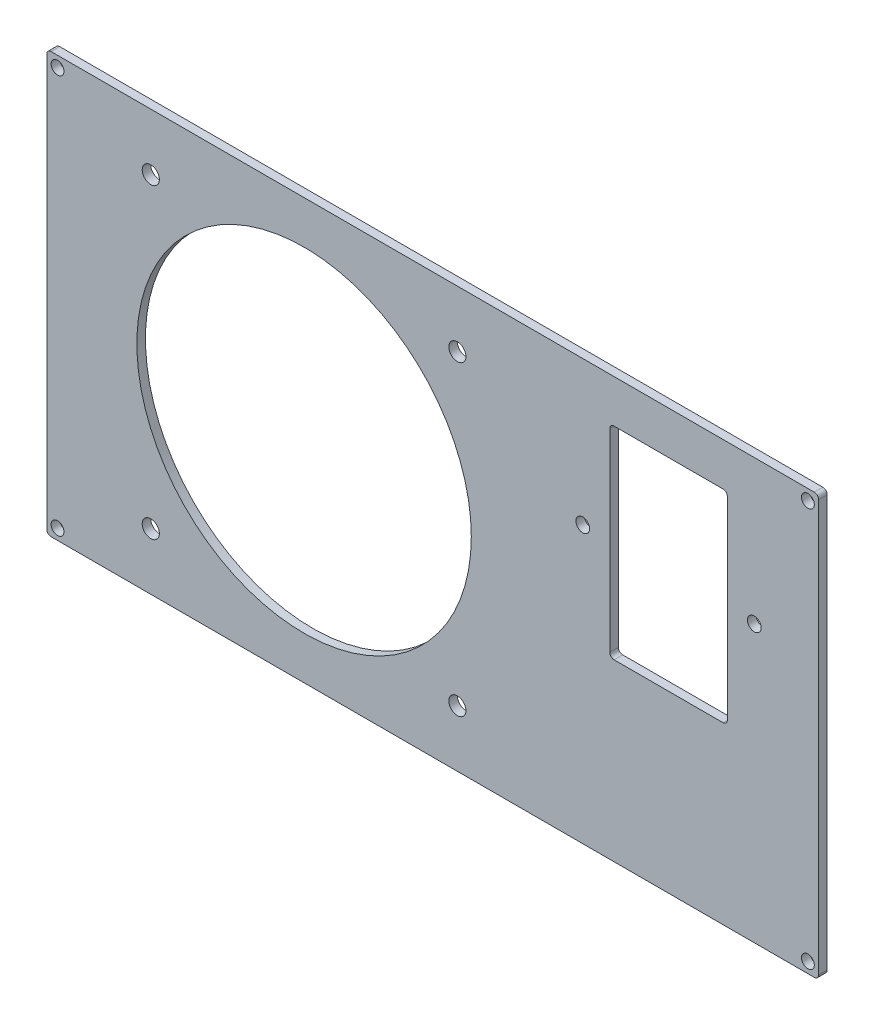
ISO-10303-21;
HEADER;
FILE_DESCRIPTION(('STEP AP214'),'2;1');
FILE_NAME('part.step','',(''),(''),'','','');
FILE_SCHEMA(('AUTOMOTIVE_DESIGN { 1 0 10303 214 1 1 1 1 }'));
ENDSEC;
DATA;
#1=APPLICATION_CONTEXT('core data for automotive mechanical design processes');
#2=APPLICATION_PROTOCOL_DEFINITION('international standard','automotive_design',2000,#1);
#3=PRODUCT_CONTEXT('',#1,'mechanical');
#4=PRODUCT('Part','Part','',(#3));
#5=PRODUCT_RELATED_PRODUCT_CATEGORY('part','',(#4));
#6=PRODUCT_DEFINITION_FORMATION('','',#4);
#7=PRODUCT_DEFINITION_CONTEXT('part definition',#1,'design');
#8=PRODUCT_DEFINITION('design','',#6,#7);
#9=PRODUCT_DEFINITION_SHAPE('','',#8);
#10=(LENGTH_UNIT() NAMED_UNIT(*) SI_UNIT(.MILLI.,.METRE.));
#11=(NAMED_UNIT(*) PLANE_ANGLE_UNIT() SI_UNIT($,.RADIAN.));
#12=(NAMED_UNIT(*) SI_UNIT($,.STERADIAN.) SOLID_ANGLE_UNIT());
#13=UNCERTAINTY_MEASURE_WITH_UNIT(LENGTH_MEASURE(1.E-05),#10,'distance_accuracy_value','');
#14=(GEOMETRIC_REPRESENTATION_CONTEXT(3) GLOBAL_UNCERTAINTY_ASSIGNED_CONTEXT((#13)) GLOBAL_UNIT_ASSIGNED_CONTEXT((#10,
#11,#12)) REPRESENTATION_CONTEXT('',''));
#15=CARTESIAN_POINT('',(0.,0.,0.));
#16=DIRECTION('',(0.,0.,1.));
#17=DIRECTION('',(1.,0.,0.));
#18=AXIS2_PLACEMENT_3D('',#15,#16,#17);
#19=CARTESIAN_POINT('',(0.,0.,2.));
#20=DIRECTION('',(0.,0.,-1.));
#21=DIRECTION('',(-1.,0.,0.));
#22=AXIS2_PLACEMENT_3D('',#19,#20,#21);
#23=PLANE('',#22);
#24=CARTESIAN_POINT('',(24.25,13.25,2.));
#25=DIRECTION('',(0.,0.,1.));
#26=DIRECTION('',(1.,0.,0.));
#27=AXIS2_PLACEMENT_3D('',#24,#25,#26);
#28=CIRCLE('',#27,2.);
#29=CARTESIAN_POINT('',(26.25,13.25,2.));
#30=VERTEX_POINT('',#29);
#31=EDGE_CURVE('E273',#30,#30,#28,.T.);
#32=ORIENTED_EDGE('',*,*,#31,.F.);
#33=EDGE_LOOP('',(#32));
#34=FACE_BOUND('',#33,.T.);
#35=CARTESIAN_POINT('',(95.75,13.25,2.));
#36=DIRECTION('',(0.,0.,1.));
#37=DIRECTION('',(1.,0.,0.));
#38=AXIS2_PLACEMENT_3D('',#35,#36,#37);
#39=CIRCLE('',#38,2.);
#40=CARTESIAN_POINT('',(97.75,13.25,2.));
#41=VERTEX_POINT('',#40);
#42=EDGE_CURVE('E289',#41,#41,#39,.T.);
#43=ORIENTED_EDGE('',*,*,#42,.F.);
#44=EDGE_LOOP('',(#43));
#45=FACE_BOUND('',#44,.T.);
#46=CARTESIAN_POINT('',(95.75,84.75,2.));
#47=DIRECTION('',(0.,0.,1.));
#48=DIRECTION('',(1.,0.,0.));
#49=AXIS2_PLACEMENT_3D('',#46,#47,#48);
#50=CIRCLE('',#49,2.);
#51=CARTESIAN_POINT('',(97.75,84.75,2.));
#52=VERTEX_POINT('',#51);
#53=EDGE_CURVE('E295',#52,#52,#50,.T.);
#54=ORIENTED_EDGE('',*,*,#53,.F.);
#55=EDGE_LOOP('',(#54));
#56=FACE_BOUND('',#55,.T.);
#57=CARTESIAN_POINT('',(24.25,84.75,2.));
#58=DIRECTION('',(0.,0.,1.));
#59=DIRECTION('',(1.,0.,0.));
#60=AXIS2_PLACEMENT_3D('',#57,#58,#59);
#61=CIRCLE('',#60,2.);
#62=CARTESIAN_POINT('',(26.25,84.75,2.));
#63=VERTEX_POINT('',#62);
#64=EDGE_CURVE('E301',#63,#63,#61,.T.);
#65=ORIENTED_EDGE('',*,*,#64,.F.);
#66=EDGE_LOOP('',(#65));
#67=FACE_BOUND('',#66,.T.);
#68=CARTESIAN_POINT('',(60.,49.,2.));
#69=DIRECTION('',(0.,0.,1.));
#70=DIRECTION('',(1.,0.,0.));
#71=AXIS2_PLACEMENT_3D('',#68,#69,#70);
#72=CIRCLE('',#71,39.);
#73=CARTESIAN_POINT('',(99.,49.,2.));
#74=VERTEX_POINT('',#73);
#75=EDGE_CURVE('E307',#74,#74,#72,.T.);
#76=ORIENTED_EDGE('',*,*,#75,.F.);
#77=EDGE_LOOP('',(#76));
#78=FACE_BOUND('',#77,.T.);
#79=CARTESIAN_POINT('',(2.50000000000001,2.49999999999999,2.));
#80=DIRECTION('',(0.,0.,1.));
#81=DIRECTION('',(1.,0.,0.));
#82=AXIS2_PLACEMENT_3D('',#79,#80,#81);
#83=CIRCLE('',#82,1.5);
#84=CARTESIAN_POINT('',(4.00000000000001,2.49999999999999,2.));
#85=VERTEX_POINT('',#84);
#86=EDGE_CURVE('E313',#85,#85,#83,.T.);
#87=ORIENTED_EDGE('',*,*,#86,.F.);
#88=EDGE_LOOP('',(#87));
#89=FACE_BOUND('',#88,.T.);
#90=CARTESIAN_POINT('',(177.5,2.49999999999999,2.));
#91=DIRECTION('',(0.,0.,1.));
#92=DIRECTION('',(1.,0.,0.));
#93=AXIS2_PLACEMENT_3D('',#90,#91,#92);
#94=CIRCLE('',#93,1.5);
#95=CARTESIAN_POINT('',(179.,2.49999999999999,2.));
#96=VERTEX_POINT('',#95);
#97=EDGE_CURVE('E319',#96,#96,#94,.T.);
#98=ORIENTED_EDGE('',*,*,#97,.F.);
#99=EDGE_LOOP('',(#98));
#100=FACE_BOUND('',#99,.T.);
#101=CARTESIAN_POINT('',(177.5,95.5,2.));
#102=DIRECTION('',(0.,0.,1.));
#103=DIRECTION('',(1.,0.,0.));
#104=AXIS2_PLACEMENT_3D('',#101,#102,#103);
#105=CIRCLE('',#104,1.5);
#106=CARTESIAN_POINT('',(179.,95.5,2.));
#107=VERTEX_POINT('',#106);
#108=EDGE_CURVE('E325',#107,#107,#105,.T.);
#109=ORIENTED_EDGE('',*,*,#108,.F.);
#110=EDGE_LOOP('',(#109));
#111=FACE_BOUND('',#110,.T.);
#112=CARTESIAN_POINT('',(2.50000000000001,95.5,2.));
#113=DIRECTION('',(0.,0.,1.));
#114=DIRECTION('',(1.,0.,0.));
#115=AXIS2_PLACEMENT_3D('',#112,#113,#114);
#116=CIRCLE('',#115,1.5);
#117=CARTESIAN_POINT('',(4.00000000000001,95.5,2.));
#118=VERTEX_POINT('',#117);
#119=EDGE_CURVE('E176',#118,#118,#116,.T.);
#120=ORIENTED_EDGE('',*,*,#119,.F.);
#121=EDGE_LOOP('',(#120));
#122=FACE_BOUND('',#121,.T.);
#123=DIRECTION('',(-1.,0.,0.));
#124=VECTOR('',#123,1.);
#125=CARTESIAN_POINT('',(0.,98.,2.));
#126=LINE('',#125,#124);
#127=CARTESIAN_POINT('',(179.,98.,2.));
#128=VERTEX_POINT('',#127);
#129=CARTESIAN_POINT('',(1.,98.,2.));
#130=VERTEX_POINT('',#129);
#131=EDGE_CURVE('E185',#128,#130,#126,.T.);
#132=ORIENTED_EDGE('',*,*,#131,.T.);
#133=CARTESIAN_POINT('',(1.,97.,2.));
#134=DIRECTION('',(0.,0.,-1.));
#135=DIRECTION('',(-1.,0.,0.));
#136=AXIS2_PLACEMENT_3D('',#133,#134,#135);
#137=CIRCLE('',#136,1.);
#138=CARTESIAN_POINT('',(0.,97.,2.));
#139=VERTEX_POINT('',#138);
#140=EDGE_CURVE('E206',#130,#139,#137,.F.);
#141=ORIENTED_EDGE('',*,*,#140,.T.);
#142=DIRECTION('',(0.,-1.,0.));
#143=VECTOR('',#142,1.);
#144=CARTESIAN_POINT('',(0.,0.,2.));
#145=LINE('',#144,#143);
#146=CARTESIAN_POINT('',(0.,1.,2.));
#147=VERTEX_POINT('',#146);
#148=EDGE_CURVE('E168',#139,#147,#145,.T.);
#149=ORIENTED_EDGE('',*,*,#148,.T.);
#150=CARTESIAN_POINT('',(1.,1.,2.));
#151=DIRECTION('',(0.,0.,-1.));
#152=DIRECTION('',(-1.,0.,0.));
#153=AXIS2_PLACEMENT_3D('',#150,#151,#152);
#154=CIRCLE('',#153,1.);
#155=CARTESIAN_POINT('',(1.,0.,2.));
#156=VERTEX_POINT('',#155);
#157=EDGE_CURVE('E204',#147,#156,#154,.F.);
#158=ORIENTED_EDGE('',*,*,#157,.T.);
#159=DIRECTION('',(1.,0.,0.));
#160=VECTOR('',#159,1.);
#161=CARTESIAN_POINT('',(0.,0.,2.));
#162=LINE('',#161,#160);
#163=CARTESIAN_POINT('',(179.,0.,2.));
#164=VERTEX_POINT('',#163);
#165=EDGE_CURVE('E333',#156,#164,#162,.T.);
#166=ORIENTED_EDGE('',*,*,#165,.T.);
#167=CARTESIAN_POINT('',(179.,1.,2.));
#168=DIRECTION('',(0.,0.,-1.));
#169=DIRECTION('',(-1.,0.,0.));
#170=AXIS2_PLACEMENT_3D('',#167,#168,#169);
#171=CIRCLE('',#170,1.);
#172=CARTESIAN_POINT('',(180.,1.,2.));
#173=VERTEX_POINT('',#172);
#174=EDGE_CURVE('E202',#164,#173,#171,.F.);
#175=ORIENTED_EDGE('',*,*,#174,.T.);
#176=DIRECTION('',(0.,1.,0.));
#177=VECTOR('',#176,1.);
#178=CARTESIAN_POINT('',(180.,0.,2.));
#179=LINE('',#178,#177);
#180=CARTESIAN_POINT('',(180.,97.,2.));
#181=VERTEX_POINT('',#180);
#182=EDGE_CURVE('E335',#173,#181,#179,.T.);
#183=ORIENTED_EDGE('',*,*,#182,.T.);
#184=CARTESIAN_POINT('',(179.,97.,2.));
#185=DIRECTION('',(0.,0.,-1.));
#186=DIRECTION('',(-1.,0.,0.));
#187=AXIS2_PLACEMENT_3D('',#184,#185,#186);
#188=CIRCLE('',#187,1.);
#189=EDGE_CURVE('E200',#181,#128,#188,.F.);
#190=ORIENTED_EDGE('',*,*,#189,.T.);
#191=EDGE_LOOP('',(#132,#141,#149,#158,#166,#175,#183,#190));
#192=FACE_BOUND('',#191,.T.);
#193=DIRECTION('',(0.,1.,0.));
#194=VECTOR('',#193,1.);
#195=CARTESIAN_POINT('',(158.7,88.,2.));
#196=LINE('',#195,#194);
#197=CARTESIAN_POINT('',(158.7,41.8,2.));
#198=VERTEX_POINT('',#197);
#199=CARTESIAN_POINT('',(158.7,87.,2.));
#200=VERTEX_POINT('',#199);
#201=EDGE_CURVE('E285',#198,#200,#196,.T.);
#202=ORIENTED_EDGE('',*,*,#201,.F.);
#203=CARTESIAN_POINT('',(157.7,41.8,2.));
#204=DIRECTION('',(0.,0.,-1.));
#205=DIRECTION('',(-1.,0.,0.));
#206=AXIS2_PLACEMENT_3D('',#203,#204,#205);
#207=CIRCLE('',#206,1.);
#208=CARTESIAN_POINT('',(157.7,40.8,2.));
#209=VERTEX_POINT('',#208);
#210=EDGE_CURVE('E11',#198,#209,#207,.T.);
#211=ORIENTED_EDGE('',*,*,#210,.T.);
#212=DIRECTION('',(1.,0.,0.));
#213=VECTOR('',#212,1.);
#214=CARTESIAN_POINT('',(131.3,40.8,2.));
#215=LINE('',#214,#213);
#216=CARTESIAN_POINT('',(132.3,40.8,2.));
#217=VERTEX_POINT('',#216);
#218=EDGE_CURVE('E267',#217,#209,#215,.T.);
#219=ORIENTED_EDGE('',*,*,#218,.F.);
#220=CARTESIAN_POINT('',(132.3,41.8,2.));
#221=DIRECTION('',(0.,0.,-1.));
#222=DIRECTION('',(-1.,0.,0.));
#223=AXIS2_PLACEMENT_3D('',#220,#221,#222);
#224=CIRCLE('',#223,1.);
#225=CARTESIAN_POINT('',(131.3,41.8,2.));
#226=VERTEX_POINT('',#225);
#227=EDGE_CURVE('E247',#217,#226,#224,.T.);
#228=ORIENTED_EDGE('',*,*,#227,.T.);
#229=DIRECTION('',(0.,-1.,0.));
#230=VECTOR('',#229,1.);
#231=CARTESIAN_POINT('',(131.3,88.,2.));
#232=LINE('',#231,#230);
#233=CARTESIAN_POINT('',(131.3,87.,2.));
#234=VERTEX_POINT('',#233);
#235=EDGE_CURVE('E270',#234,#226,#232,.T.);
#236=ORIENTED_EDGE('',*,*,#235,.F.);
#237=CARTESIAN_POINT('',(132.3,87.,2.));
#238=DIRECTION('',(0.,0.,-1.));
#239=DIRECTION('',(-1.,0.,0.));
#240=AXIS2_PLACEMENT_3D('',#237,#238,#239);
#241=CIRCLE('',#240,1.);
#242=CARTESIAN_POINT('',(132.3,88.,2.));
#243=VERTEX_POINT('',#242);
#244=EDGE_CURVE('E243',#234,#243,#241,.T.);
#245=ORIENTED_EDGE('',*,*,#244,.T.);
#246=DIRECTION('',(-1.,0.,0.));
#247=VECTOR('',#246,1.);
#248=CARTESIAN_POINT('',(131.3,88.,2.));
#249=LINE('',#248,#247);
#250=CARTESIAN_POINT('',(157.7,88.,2.));
#251=VERTEX_POINT('',#250);
#252=EDGE_CURVE('E276',#251,#243,#249,.T.);
#253=ORIENTED_EDGE('',*,*,#252,.F.);
#254=CARTESIAN_POINT('',(157.7,87.,2.));
#255=DIRECTION('',(0.,0.,-1.));
#256=DIRECTION('',(-1.,0.,0.));
#257=AXIS2_PLACEMENT_3D('',#254,#255,#256);
#258=CIRCLE('',#257,1.);
#259=EDGE_CURVE('E239',#251,#200,#258,.T.);
#260=ORIENTED_EDGE('',*,*,#259,.T.);
#261=EDGE_LOOP('',(#202,#211,#219,#228,#236,#245,#253,#260));
#262=FACE_BOUND('',#261,.T.);
#263=CARTESIAN_POINT('',(125.,64.4,2.));
#264=DIRECTION('',(0.,0.,1.));
#265=DIRECTION('',(1.,0.,0.));
#266=AXIS2_PLACEMENT_3D('',#263,#264,#265);
#267=CIRCLE('',#266,1.60000000000001);
#268=CARTESIAN_POINT('',(126.6,64.4,2.));
#269=VERTEX_POINT('',#268);
#270=EDGE_CURVE('E264',#269,#269,#267,.T.);
#271=ORIENTED_EDGE('',*,*,#270,.F.);
#272=EDGE_LOOP('',(#271));
#273=FACE_BOUND('',#272,.T.);
#274=CARTESIAN_POINT('',(165.,64.4,2.));
#275=DIRECTION('',(0.,0.,1.));
#276=DIRECTION('',(1.,0.,0.));
#277=AXIS2_PLACEMENT_3D('',#274,#275,#276);
#278=CIRCLE('',#277,1.59999999999999);
#279=CARTESIAN_POINT('',(166.6,64.4,2.));
#280=VERTEX_POINT('',#279);
#281=EDGE_CURVE('E646',#280,#280,#278,.T.);
#282=ORIENTED_EDGE('',*,*,#281,.F.);
#283=EDGE_LOOP('',(#282));
#284=FACE_BOUND('',#283,.T.);
#285=ADVANCED_FACE('F35',(#34,#45,#56,#67,#78,#89,#100,#111,#122,#192,#262,#273,#284),#23,.F.);
#286=CARTESIAN_POINT('',(0.,0.,0.));
#287=DIRECTION('',(0.,0.,-1.));
#288=DIRECTION('',(-1.,0.,0.));
#289=AXIS2_PLACEMENT_3D('',#286,#287,#288);
#290=PLANE('',#289);
#291=CARTESIAN_POINT('',(125.,64.4,0.));
#292=DIRECTION('',(0.,0.,1.));
#293=DIRECTION('',(1.,0.,0.));
#294=AXIS2_PLACEMENT_3D('',#291,#292,#293);
#295=CIRCLE('',#294,1.60000000000001);
#296=CARTESIAN_POINT('',(126.6,64.4,0.));
#297=VERTEX_POINT('',#296);
#298=EDGE_CURVE('E643',#297,#297,#295,.T.);
#299=ORIENTED_EDGE('',*,*,#298,.T.);
#300=EDGE_LOOP('',(#299));
#301=FACE_BOUND('',#300,.T.);
#302=CARTESIAN_POINT('',(95.75,13.25,0.));
#303=DIRECTION('',(0.,0.,1.));
#304=DIRECTION('',(1.,0.,0.));
#305=AXIS2_PLACEMENT_3D('',#302,#303,#304);
#306=CIRCLE('',#305,2.);
#307=CARTESIAN_POINT('',(97.75,13.25,0.));
#308=VERTEX_POINT('',#307);
#309=EDGE_CURVE('E287',#308,#308,#306,.T.);
#310=ORIENTED_EDGE('',*,*,#309,.T.);
#311=EDGE_LOOP('',(#310));
#312=FACE_BOUND('',#311,.T.);
#313=CARTESIAN_POINT('',(24.25,84.75,0.));
#314=DIRECTION('',(0.,0.,1.));
#315=DIRECTION('',(1.,0.,0.));
#316=AXIS2_PLACEMENT_3D('',#313,#314,#315);
#317=CIRCLE('',#316,2.);
#318=CARTESIAN_POINT('',(26.25,84.75,0.));
#319=VERTEX_POINT('',#318);
#320=EDGE_CURVE('E298',#319,#319,#317,.T.);
#321=ORIENTED_EDGE('',*,*,#320,.T.);
#322=EDGE_LOOP('',(#321));
#323=FACE_BOUND('',#322,.T.);
#324=CARTESIAN_POINT('',(2.50000000000001,2.49999999999999,0.));
#325=DIRECTION('',(0.,0.,1.));
#326=DIRECTION('',(1.,0.,0.));
#327=AXIS2_PLACEMENT_3D('',#324,#325,#326);
#328=CIRCLE('',#327,1.5);
#329=CARTESIAN_POINT('',(4.00000000000001,2.49999999999999,0.));
#330=VERTEX_POINT('',#329);
#331=EDGE_CURVE('E310',#330,#330,#328,.T.);
#332=ORIENTED_EDGE('',*,*,#331,.T.);
#333=EDGE_LOOP('',(#332));
#334=FACE_BOUND('',#333,.T.);
#335=CARTESIAN_POINT('',(177.5,95.5,0.));
#336=DIRECTION('',(0.,0.,1.));
#337=DIRECTION('',(1.,0.,0.));
#338=AXIS2_PLACEMENT_3D('',#335,#336,#337);
#339=CIRCLE('',#338,1.5);
#340=CARTESIAN_POINT('',(179.,95.5,0.));
#341=VERTEX_POINT('',#340);
#342=EDGE_CURVE('E322',#341,#341,#339,.T.);
#343=ORIENTED_EDGE('',*,*,#342,.T.);
#344=EDGE_LOOP('',(#343));
#345=FACE_BOUND('',#344,.T.);
#346=DIRECTION('',(0.,-1.,0.));
#347=VECTOR('',#346,1.);
#348=CARTESIAN_POINT('',(0.,0.,0.));
#349=LINE('',#348,#347);
#350=CARTESIAN_POINT('',(0.,97.,0.));
#351=VERTEX_POINT('',#350);
#352=CARTESIAN_POINT('',(0.,1.,0.));
#353=VERTEX_POINT('',#352);
#354=EDGE_CURVE('E165',#351,#353,#349,.T.);
#355=ORIENTED_EDGE('',*,*,#354,.F.);
#356=CARTESIAN_POINT('',(1.,97.,0.));
#357=DIRECTION('',(0.,0.,-1.));
#358=DIRECTION('',(-1.,0.,0.));
#359=AXIS2_PLACEMENT_3D('',#356,#357,#358);
#360=CIRCLE('',#359,1.);
#361=CARTESIAN_POINT('',(1.,98.,0.));
#362=VERTEX_POINT('',#361);
#363=EDGE_CURVE('E148',#351,#362,#360,.T.);
#364=ORIENTED_EDGE('',*,*,#363,.T.);
#365=DIRECTION('',(-1.,0.,0.));
#366=VECTOR('',#365,1.);
#367=CARTESIAN_POINT('',(0.,98.,0.));
#368=LINE('',#367,#366);
#369=CARTESIAN_POINT('',(179.,98.,0.));
#370=VERTEX_POINT('',#369);
#371=EDGE_CURVE('E190',#370,#362,#368,.T.);
#372=ORIENTED_EDGE('',*,*,#371,.F.);
#373=CARTESIAN_POINT('',(179.,97.,0.));
#374=DIRECTION('',(0.,0.,-1.));
#375=DIRECTION('',(-1.,0.,0.));
#376=AXIS2_PLACEMENT_3D('',#373,#374,#375);
#377=CIRCLE('',#376,1.);
#378=CARTESIAN_POINT('',(180.,97.,0.));
#379=VERTEX_POINT('',#378);
#380=EDGE_CURVE('E169',#370,#379,#377,.T.);
#381=ORIENTED_EDGE('',*,*,#380,.T.);
#382=DIRECTION('',(0.,1.,0.));
#383=VECTOR('',#382,1.);
#384=CARTESIAN_POINT('',(180.,0.,0.));
#385=LINE('',#384,#383);
#386=CARTESIAN_POINT('',(180.,1.,0.));
#387=VERTEX_POINT('',#386);
#388=EDGE_CURVE('E179',#387,#379,#385,.T.);
#389=ORIENTED_EDGE('',*,*,#388,.F.);
#390=CARTESIAN_POINT('',(179.,1.,0.));
#391=DIRECTION('',(0.,0.,-1.));
#392=DIRECTION('',(-1.,0.,0.));
#393=AXIS2_PLACEMENT_3D('',#390,#391,#392);
#394=CIRCLE('',#393,1.);
#395=CARTESIAN_POINT('',(179.,0.,0.));
#396=VERTEX_POINT('',#395);
#397=EDGE_CURVE('E194',#387,#396,#394,.T.);
#398=ORIENTED_EDGE('',*,*,#397,.T.);
#399=DIRECTION('',(1.,0.,0.));
#400=VECTOR('',#399,1.);
#401=CARTESIAN_POINT('',(0.,0.,0.));
#402=LINE('',#401,#400);
#403=CARTESIAN_POINT('',(1.,0.,0.));
#404=VERTEX_POINT('',#403);
#405=EDGE_CURVE('E175',#404,#396,#402,.T.);
#406=ORIENTED_EDGE('',*,*,#405,.F.);
#407=CARTESIAN_POINT('',(1.,1.,0.));
#408=DIRECTION('',(0.,0.,-1.));
#409=DIRECTION('',(-1.,0.,0.));
#410=AXIS2_PLACEMENT_3D('',#407,#408,#409);
#411=CIRCLE('',#410,1.);
#412=EDGE_CURVE('E159',#404,#353,#411,.T.);
#413=ORIENTED_EDGE('',*,*,#412,.T.);
#414=EDGE_LOOP('',(#355,#364,#372,#381,#389,#398,#406,#413));
#415=FACE_BOUND('',#414,.T.);
#416=CARTESIAN_POINT('',(2.50000000000001,95.5,0.));
#417=DIRECTION('',(0.,0.,1.));
#418=DIRECTION('',(1.,0.,0.));
#419=AXIS2_PLACEMENT_3D('',#416,#417,#418);
#420=CIRCLE('',#419,1.5);
#421=CARTESIAN_POINT('',(4.00000000000001,95.5,0.));
#422=VERTEX_POINT('',#421);
#423=EDGE_CURVE('E182',#422,#422,#420,.T.);
#424=ORIENTED_EDGE('',*,*,#423,.T.);
#425=EDGE_LOOP('',(#424));
#426=FACE_BOUND('',#425,.T.);
#427=CARTESIAN_POINT('',(177.5,2.49999999999999,0.));
#428=DIRECTION('',(0.,0.,1.));
#429=DIRECTION('',(1.,0.,0.));
#430=AXIS2_PLACEMENT_3D('',#427,#428,#429);
#431=CIRCLE('',#430,1.5);
#432=CARTESIAN_POINT('',(179.,2.49999999999999,0.));
#433=VERTEX_POINT('',#432);
#434=EDGE_CURVE('E316',#433,#433,#431,.T.);
#435=ORIENTED_EDGE('',*,*,#434,.T.);
#436=EDGE_LOOP('',(#435));
#437=FACE_BOUND('',#436,.T.);
#438=CARTESIAN_POINT('',(60.,49.,0.));
#439=DIRECTION('',(0.,0.,1.));
#440=DIRECTION('',(1.,0.,0.));
#441=AXIS2_PLACEMENT_3D('',#438,#439,#440);
#442=CIRCLE('',#441,39.);
#443=CARTESIAN_POINT('',(99.,49.,0.));
#444=VERTEX_POINT('',#443);
#445=EDGE_CURVE('E304',#444,#444,#442,.T.);
#446=ORIENTED_EDGE('',*,*,#445,.T.);
#447=EDGE_LOOP('',(#446));
#448=FACE_BOUND('',#447,.T.);
#449=CARTESIAN_POINT('',(95.75,84.75,0.));
#450=DIRECTION('',(0.,0.,1.));
#451=DIRECTION('',(1.,0.,0.));
#452=AXIS2_PLACEMENT_3D('',#449,#450,#451);
#453=CIRCLE('',#452,2.);
#454=CARTESIAN_POINT('',(97.75,84.75,0.));
#455=VERTEX_POINT('',#454);
#456=EDGE_CURVE('E292',#455,#455,#453,.T.);
#457=ORIENTED_EDGE('',*,*,#456,.T.);
#458=EDGE_LOOP('',(#457));
#459=FACE_BOUND('',#458,.T.);
#460=CARTESIAN_POINT('',(24.25,13.25,0.));
#461=DIRECTION('',(0.,0.,1.));
#462=DIRECTION('',(1.,0.,0.));
#463=AXIS2_PLACEMENT_3D('',#460,#461,#462);
#464=CIRCLE('',#463,2.);
#465=CARTESIAN_POINT('',(26.25,13.25,0.));
#466=VERTEX_POINT('',#465);
#467=EDGE_CURVE('E269',#466,#466,#464,.T.);
#468=ORIENTED_EDGE('',*,*,#467,.T.);
#469=EDGE_LOOP('',(#468));
#470=FACE_BOUND('',#469,.T.);
#471=DIRECTION('',(0.,-1.,0.));
#472=VECTOR('',#471,1.);
#473=CARTESIAN_POINT('',(131.3,88.,0.));
#474=LINE('',#473,#472);
#475=CARTESIAN_POINT('',(131.3,87.,0.));
#476=VERTEX_POINT('',#475);
#477=CARTESIAN_POINT('',(131.3,41.8,0.));
#478=VERTEX_POINT('',#477);
#479=EDGE_CURVE('E282',#476,#478,#474,.T.);
#480=ORIENTED_EDGE('',*,*,#479,.T.);
#481=CARTESIAN_POINT('',(132.3,41.8,0.));
#482=DIRECTION('',(0.,0.,-1.));
#483=DIRECTION('',(-1.,0.,0.));
#484=AXIS2_PLACEMENT_3D('',#481,#482,#483);
#485=CIRCLE('',#484,1.);
#486=CARTESIAN_POINT('',(132.3,40.8,0.));
#487=VERTEX_POINT('',#486);
#488=EDGE_CURVE('E245',#478,#487,#485,.F.);
#489=ORIENTED_EDGE('',*,*,#488,.T.);
#490=DIRECTION('',(1.,0.,0.));
#491=VECTOR('',#490,1.);
#492=CARTESIAN_POINT('',(131.3,40.8,0.));
#493=LINE('',#492,#491);
#494=CARTESIAN_POINT('',(157.7,40.8,0.));
#495=VERTEX_POINT('',#494);
#496=EDGE_CURVE('E255',#487,#495,#493,.T.);
#497=ORIENTED_EDGE('',*,*,#496,.T.);
#498=CARTESIAN_POINT('',(157.7,41.8,0.));
#499=DIRECTION('',(0.,0.,-1.));
#500=DIRECTION('',(-1.,0.,0.));
#501=AXIS2_PLACEMENT_3D('',#498,#499,#500);
#502=CIRCLE('',#501,1.);
#503=CARTESIAN_POINT('',(158.7,41.8,0.));
#504=VERTEX_POINT('',#503);
#505=EDGE_CURVE('E43',#495,#504,#502,.F.);
#506=ORIENTED_EDGE('',*,*,#505,.T.);
#507=DIRECTION('',(0.,1.,0.));
#508=VECTOR('',#507,1.);
#509=CARTESIAN_POINT('',(158.7,88.,0.));
#510=LINE('',#509,#508);
#511=CARTESIAN_POINT('',(158.7,87.,0.));
#512=VERTEX_POINT('',#511);
#513=EDGE_CURVE('E254',#504,#512,#510,.T.);
#514=ORIENTED_EDGE('',*,*,#513,.T.);
#515=CARTESIAN_POINT('',(157.7,87.,0.));
#516=DIRECTION('',(0.,0.,-1.));
#517=DIRECTION('',(-1.,0.,0.));
#518=AXIS2_PLACEMENT_3D('',#515,#516,#517);
#519=CIRCLE('',#518,1.);
#520=CARTESIAN_POINT('',(157.7,88.,0.));
#521=VERTEX_POINT('',#520);
#522=EDGE_CURVE('E237',#512,#521,#519,.F.);
#523=ORIENTED_EDGE('',*,*,#522,.T.);
#524=DIRECTION('',(-1.,0.,0.));
#525=VECTOR('',#524,1.);
#526=CARTESIAN_POINT('',(131.3,88.,0.));
#527=LINE('',#526,#525);
#528=CARTESIAN_POINT('',(132.3,88.,0.));
#529=VERTEX_POINT('',#528);
#530=EDGE_CURVE('E263',#521,#529,#527,.T.);
#531=ORIENTED_EDGE('',*,*,#530,.T.);
#532=CARTESIAN_POINT('',(132.3,87.,0.));
#533=DIRECTION('',(0.,0.,-1.));
#534=DIRECTION('',(-1.,0.,0.));
#535=AXIS2_PLACEMENT_3D('',#532,#533,#534);
#536=CIRCLE('',#535,1.);
#537=EDGE_CURVE('E241',#529,#476,#536,.F.);
#538=ORIENTED_EDGE('',*,*,#537,.T.);
#539=EDGE_LOOP('',(#480,#489,#497,#506,#514,#523,#531,#538));
#540=FACE_BOUND('',#539,.T.);
#541=CARTESIAN_POINT('',(165.,64.4,0.));
#542=DIRECTION('',(0.,0.,1.));
#543=DIRECTION('',(1.,0.,0.));
#544=AXIS2_PLACEMENT_3D('',#541,#542,#543);
#545=CIRCLE('',#544,1.59999999999999);
#546=CARTESIAN_POINT('',(166.6,64.4,0.));
#547=VERTEX_POINT('',#546);
#548=EDGE_CURVE('E649',#547,#547,#545,.T.);
#549=ORIENTED_EDGE('',*,*,#548,.T.);
#550=EDGE_LOOP('',(#549));
#551=FACE_BOUND('',#550,.T.);
#552=ADVANCED_FACE('F172',(#301,#312,#323,#334,#345,#415,#426,#437,#448,#459,#470,#540,#551),
#290,.T.);
#553=CARTESIAN_POINT('',(0.,0.,2.));
#554=DIRECTION('',(1.,0.,0.));
#555=DIRECTION('',(0.,0.,-1.));
#556=AXIS2_PLACEMENT_3D('',#553,#554,#555);
#557=PLANE('',#556);
#558=ORIENTED_EDGE('',*,*,#148,.F.);
#559=DIRECTION('',(0.,0.,-1.));
#560=VECTOR('',#559,1.);
#561=CARTESIAN_POINT('',(0.,97.,2.));
#562=LINE('',#561,#560);
#563=EDGE_CURVE('E152',#139,#351,#562,.T.);
#564=ORIENTED_EDGE('',*,*,#563,.T.);
#565=ORIENTED_EDGE('',*,*,#354,.T.);
#566=DIRECTION('',(0.,0.,-1.));
#567=VECTOR('',#566,1.);
#568=CARTESIAN_POINT('',(0.,1.,2.));
#569=LINE('',#568,#567);
#570=EDGE_CURVE('E170',#353,#147,#569,.F.);
#571=ORIENTED_EDGE('',*,*,#570,.T.);
#572=EDGE_LOOP('',(#558,#564,#565,#571));
#573=FACE_BOUND('',#572,.T.);
#574=ADVANCED_FACE('F164',(#573),#557,.F.);
#575=CARTESIAN_POINT('',(0.,0.,2.));
#576=DIRECTION('',(0.,1.,0.));
#577=DIRECTION('',(0.,0.,1.));
#578=AXIS2_PLACEMENT_3D('',#575,#576,#577);
#579=PLANE('',#578);
#580=ORIENTED_EDGE('',*,*,#165,.F.);
#581=DIRECTION('',(0.,0.,-1.));
#582=VECTOR('',#581,1.);
#583=CARTESIAN_POINT('',(1.,0.,2.));
#584=LINE('',#583,#582);
#585=EDGE_CURVE('E210',#156,#404,#584,.T.);
#586=ORIENTED_EDGE('',*,*,#585,.T.);
#587=ORIENTED_EDGE('',*,*,#405,.T.);
#588=DIRECTION('',(0.,0.,-1.));
#589=VECTOR('',#588,1.);
#590=CARTESIAN_POINT('',(179.,0.,2.));
#591=LINE('',#590,#589);
#592=EDGE_CURVE('E208',#396,#164,#591,.F.);
#593=ORIENTED_EDGE('',*,*,#592,.T.);
#594=EDGE_LOOP('',(#580,#586,#587,#593));
#595=FACE_BOUND('',#594,.T.);
#596=ADVANCED_FACE('F358',(#595),#579,.F.);
#597=CARTESIAN_POINT('',(180.,0.,2.));
#598=DIRECTION('',(-1.,0.,0.));
#599=DIRECTION('',(0.,0.,1.));
#600=AXIS2_PLACEMENT_3D('',#597,#598,#599);
#601=PLANE('',#600);
#602=ORIENTED_EDGE('',*,*,#182,.F.);
#603=DIRECTION('',(0.,0.,-1.));
#604=VECTOR('',#603,1.);
#605=CARTESIAN_POINT('',(180.,1.,2.));
#606=LINE('',#605,#604);
#607=EDGE_CURVE('E215',#173,#387,#606,.T.);
#608=ORIENTED_EDGE('',*,*,#607,.T.);
#609=ORIENTED_EDGE('',*,*,#388,.T.);
#610=DIRECTION('',(0.,0.,-1.));
#611=VECTOR('',#610,1.);
#612=CARTESIAN_POINT('',(180.,97.,2.));
#613=LINE('',#612,#611);
#614=EDGE_CURVE('E213',#379,#181,#613,.F.);
#615=ORIENTED_EDGE('',*,*,#614,.T.);
#616=EDGE_LOOP('',(#602,#608,#609,#615));
#617=FACE_BOUND('',#616,.T.);
#618=ADVANCED_FACE('F350',(#617),#601,.F.);
#619=CARTESIAN_POINT('',(0.,98.,2.));
#620=DIRECTION('',(0.,-1.,0.));
#621=DIRECTION('',(0.,0.,-1.));
#622=AXIS2_PLACEMENT_3D('',#619,#620,#621);
#623=PLANE('',#622);
#624=ORIENTED_EDGE('',*,*,#371,.T.);
#625=DIRECTION('',(0.,0.,-1.));
#626=VECTOR('',#625,1.);
#627=CARTESIAN_POINT('',(1.,98.,2.));
#628=LINE('',#627,#626);
#629=EDGE_CURVE('E153',#362,#130,#628,.F.);
#630=ORIENTED_EDGE('',*,*,#629,.T.);
#631=ORIENTED_EDGE('',*,*,#131,.F.);
#632=DIRECTION('',(0.,0.,-1.));
#633=VECTOR('',#632,1.);
#634=CARTESIAN_POINT('',(179.,98.,2.));
#635=LINE('',#634,#633);
#636=EDGE_CURVE('E158',#128,#370,#635,.T.);
#637=ORIENTED_EDGE('',*,*,#636,.T.);
#638=EDGE_LOOP('',(#624,#630,#631,#637));
#639=FACE_BOUND('',#638,.T.);
#640=ADVANCED_FACE('F344',(#639),#623,.F.);
#641=CARTESIAN_POINT('',(2.50000000000001,95.5,2.));
#642=DIRECTION('',(0.,0.,-1.));
#643=DIRECTION('',(-1.,0.,0.));
#644=AXIS2_PLACEMENT_3D('',#641,#642,#643);
#645=CYLINDRICAL_SURFACE('',#644,1.5);
#646=ORIENTED_EDGE('',*,*,#119,.T.);
#647=EDGE_LOOP('',(#646));
#648=FACE_BOUND('',#647,.T.);
#649=ORIENTED_EDGE('',*,*,#423,.F.);
#650=EDGE_LOOP('',(#649));
#651=FACE_BOUND('',#650,.T.);
#652=ADVANCED_FACE('F383',(#648,#651),#645,.F.);
#653=CARTESIAN_POINT('',(177.5,95.5,2.));
#654=DIRECTION('',(0.,0.,-1.));
#655=DIRECTION('',(-1.,0.,0.));
#656=AXIS2_PLACEMENT_3D('',#653,#654,#655);
#657=CYLINDRICAL_SURFACE('',#656,1.5);
#658=ORIENTED_EDGE('',*,*,#108,.T.);
#659=EDGE_LOOP('',(#658));
#660=FACE_BOUND('',#659,.T.);
#661=ORIENTED_EDGE('',*,*,#342,.F.);
#662=EDGE_LOOP('',(#661));
#663=FACE_BOUND('',#662,.T.);
#664=ADVANCED_FACE('F417',(#660,#663),#657,.F.);
#665=CARTESIAN_POINT('',(177.5,2.49999999999999,2.));
#666=DIRECTION('',(0.,0.,-1.));
#667=DIRECTION('',(-1.,0.,0.));
#668=AXIS2_PLACEMENT_3D('',#665,#666,#667);
#669=CYLINDRICAL_SURFACE('',#668,1.5);
#670=ORIENTED_EDGE('',*,*,#97,.T.);
#671=EDGE_LOOP('',(#670));
#672=FACE_BOUND('',#671,.T.);
#673=ORIENTED_EDGE('',*,*,#434,.F.);
#674=EDGE_LOOP('',(#673));
#675=FACE_BOUND('',#674,.T.);
#676=ADVANCED_FACE('F424',(#672,#675),#669,.F.);
#677=CARTESIAN_POINT('',(2.50000000000001,2.49999999999999,2.));
#678=DIRECTION('',(0.,0.,-1.));
#679=DIRECTION('',(-1.,0.,0.));
#680=AXIS2_PLACEMENT_3D('',#677,#678,#679);
#681=CYLINDRICAL_SURFACE('',#680,1.5);
#682=ORIENTED_EDGE('',*,*,#86,.T.);
#683=EDGE_LOOP('',(#682));
#684=FACE_BOUND('',#683,.T.);
#685=ORIENTED_EDGE('',*,*,#331,.F.);
#686=EDGE_LOOP('',(#685));
#687=FACE_BOUND('',#686,.T.);
#688=ADVANCED_FACE('F431',(#684,#687),#681,.F.);
#689=CARTESIAN_POINT('',(60.,49.,2.));
#690=DIRECTION('',(0.,0.,-1.));
#691=DIRECTION('',(-1.,0.,0.));
#692=AXIS2_PLACEMENT_3D('',#689,#690,#691);
#693=CYLINDRICAL_SURFACE('',#692,39.);
#694=ORIENTED_EDGE('',*,*,#75,.T.);
#695=EDGE_LOOP('',(#694));
#696=FACE_BOUND('',#695,.T.);
#697=ORIENTED_EDGE('',*,*,#445,.F.);
#698=EDGE_LOOP('',(#697));
#699=FACE_BOUND('',#698,.T.);
#700=ADVANCED_FACE('F439',(#696,#699),#693,.F.);
#701=CARTESIAN_POINT('',(24.25,84.75,2.));
#702=DIRECTION('',(0.,0.,-1.));
#703=DIRECTION('',(-1.,0.,0.));
#704=AXIS2_PLACEMENT_3D('',#701,#702,#703);
#705=CYLINDRICAL_SURFACE('',#704,2.);
#706=ORIENTED_EDGE('',*,*,#64,.T.);
#707=EDGE_LOOP('',(#706));
#708=FACE_BOUND('',#707,.T.);
#709=ORIENTED_EDGE('',*,*,#320,.F.);
#710=EDGE_LOOP('',(#709));
#711=FACE_BOUND('',#710,.T.);
#712=ADVANCED_FACE('F447',(#708,#711),#705,.F.);
#713=CARTESIAN_POINT('',(95.75,84.75,2.));
#714=DIRECTION('',(0.,0.,-1.));
#715=DIRECTION('',(-1.,0.,0.));
#716=AXIS2_PLACEMENT_3D('',#713,#714,#715);
#717=CYLINDRICAL_SURFACE('',#716,2.);
#718=ORIENTED_EDGE('',*,*,#53,.T.);
#719=EDGE_LOOP('',(#718));
#720=FACE_BOUND('',#719,.T.);
#721=ORIENTED_EDGE('',*,*,#456,.F.);
#722=EDGE_LOOP('',(#721));
#723=FACE_BOUND('',#722,.T.);
#724=ADVANCED_FACE('F455',(#720,#723),#717,.F.);
#725=CARTESIAN_POINT('',(95.75,13.25,2.));
#726=DIRECTION('',(0.,0.,-1.));
#727=DIRECTION('',(-1.,0.,0.));
#728=AXIS2_PLACEMENT_3D('',#725,#726,#727);
#729=CYLINDRICAL_SURFACE('',#728,2.);
#730=ORIENTED_EDGE('',*,*,#42,.T.);
#731=EDGE_LOOP('',(#730));
#732=FACE_BOUND('',#731,.T.);
#733=ORIENTED_EDGE('',*,*,#309,.F.);
#734=EDGE_LOOP('',(#733));
#735=FACE_BOUND('',#734,.T.);
#736=ADVANCED_FACE('F463',(#732,#735),#729,.F.);
#737=CARTESIAN_POINT('',(24.25,13.25,2.));
#738=DIRECTION('',(0.,0.,-1.));
#739=DIRECTION('',(-1.,0.,0.));
#740=AXIS2_PLACEMENT_3D('',#737,#738,#739);
#741=CYLINDRICAL_SURFACE('',#740,2.);
#742=ORIENTED_EDGE('',*,*,#31,.T.);
#743=EDGE_LOOP('',(#742));
#744=FACE_BOUND('',#743,.T.);
#745=ORIENTED_EDGE('',*,*,#467,.F.);
#746=EDGE_LOOP('',(#745));
#747=FACE_BOUND('',#746,.T.);
#748=ADVANCED_FACE('F471',(#744,#747),#741,.F.);
#749=CARTESIAN_POINT('',(158.7,88.,2.));
#750=DIRECTION('',(-1.,0.,0.));
#751=DIRECTION('',(0.,0.,1.));
#752=AXIS2_PLACEMENT_3D('',#749,#750,#751);
#753=PLANE('',#752);
#754=ORIENTED_EDGE('',*,*,#201,.T.);
#755=DIRECTION('',(0.,0.,-1.));
#756=VECTOR('',#755,1.);
#757=CARTESIAN_POINT('',(158.7,87.,0.));
#758=LINE('',#757,#756);
#759=EDGE_CURVE('E220',#200,#512,#758,.T.);
#760=ORIENTED_EDGE('',*,*,#759,.T.);
#761=ORIENTED_EDGE('',*,*,#513,.F.);
#762=DIRECTION('',(0.,0.,-1.));
#763=VECTOR('',#762,1.);
#764=CARTESIAN_POINT('',(158.7,41.8,2.));
#765=LINE('',#764,#763);
#766=EDGE_CURVE('E218',#504,#198,#765,.F.);
#767=ORIENTED_EDGE('',*,*,#766,.T.);
#768=EDGE_LOOP('',(#754,#760,#761,#767));
#769=FACE_BOUND('',#768,.T.);
#770=ADVANCED_FACE('F261',(#769),#753,.T.);
#771=CARTESIAN_POINT('',(131.3,88.,2.));
#772=DIRECTION('',(0.,-1.,0.));
#773=DIRECTION('',(0.,0.,-1.));
#774=AXIS2_PLACEMENT_3D('',#771,#772,#773);
#775=PLANE('',#774);
#776=ORIENTED_EDGE('',*,*,#530,.F.);
#777=DIRECTION('',(0.,0.,-1.));
#778=VECTOR('',#777,1.);
#779=CARTESIAN_POINT('',(157.7,88.,2.));
#780=LINE('',#779,#778);
#781=EDGE_CURVE('E226',#521,#251,#780,.F.);
#782=ORIENTED_EDGE('',*,*,#781,.T.);
#783=ORIENTED_EDGE('',*,*,#252,.T.);
#784=DIRECTION('',(0.,0.,-1.));
#785=VECTOR('',#784,1.);
#786=CARTESIAN_POINT('',(132.3,88.,0.));
#787=LINE('',#786,#785);
#788=EDGE_CURVE('E223',#243,#529,#787,.T.);
#789=ORIENTED_EDGE('',*,*,#788,.T.);
#790=EDGE_LOOP('',(#776,#782,#783,#789));
#791=FACE_BOUND('',#790,.T.);
#792=ADVANCED_FACE('F487',(#791),#775,.T.);
#793=CARTESIAN_POINT('',(131.3,88.,2.));
#794=DIRECTION('',(1.,0.,0.));
#795=DIRECTION('',(0.,0.,-1.));
#796=AXIS2_PLACEMENT_3D('',#793,#794,#795);
#797=PLANE('',#796);
#798=ORIENTED_EDGE('',*,*,#479,.F.);
#799=DIRECTION('',(0.,0.,-1.));
#800=VECTOR('',#799,1.);
#801=CARTESIAN_POINT('',(131.3,87.,2.));
#802=LINE('',#801,#800);
#803=EDGE_CURVE('E231',#476,#234,#802,.F.);
#804=ORIENTED_EDGE('',*,*,#803,.T.);
#805=ORIENTED_EDGE('',*,*,#235,.T.);
#806=DIRECTION('',(0.,0.,-1.));
#807=VECTOR('',#806,1.);
#808=CARTESIAN_POINT('',(131.3,41.8,0.));
#809=LINE('',#808,#807);
#810=EDGE_CURVE('E228',#226,#478,#809,.T.);
#811=ORIENTED_EDGE('',*,*,#810,.T.);
#812=EDGE_LOOP('',(#798,#804,#805,#811));
#813=FACE_BOUND('',#812,.T.);
#814=ADVANCED_FACE('F494',(#813),#797,.T.);
#815=CARTESIAN_POINT('',(131.3,40.8,2.));
#816=DIRECTION('',(0.,1.,0.));
#817=DIRECTION('',(0.,0.,1.));
#818=AXIS2_PLACEMENT_3D('',#815,#816,#817);
#819=PLANE('',#818);
#820=ORIENTED_EDGE('',*,*,#496,.F.);
#821=DIRECTION('',(0.,0.,-1.));
#822=VECTOR('',#821,1.);
#823=CARTESIAN_POINT('',(132.3,40.8,2.));
#824=LINE('',#823,#822);
#825=EDGE_CURVE('E55',#487,#217,#824,.F.);
#826=ORIENTED_EDGE('',*,*,#825,.T.);
#827=ORIENTED_EDGE('',*,*,#218,.T.);
#828=DIRECTION('',(0.,0.,-1.));
#829=VECTOR('',#828,1.);
#830=CARTESIAN_POINT('',(157.7,40.8,0.));
#831=LINE('',#830,#829);
#832=EDGE_CURVE('E233',#209,#495,#831,.T.);
#833=ORIENTED_EDGE('',*,*,#832,.T.);
#834=EDGE_LOOP('',(#820,#826,#827,#833));
#835=FACE_BOUND('',#834,.T.);
#836=ADVANCED_FACE('F266',(#835),#819,.T.);
#837=CARTESIAN_POINT('',(125.,64.4,2.));
#838=DIRECTION('',(0.,0.,-1.));
#839=DIRECTION('',(-1.,0.,0.));
#840=AXIS2_PLACEMENT_3D('',#837,#838,#839);
#841=CYLINDRICAL_SURFACE('',#840,1.60000000000001);
#842=ORIENTED_EDGE('',*,*,#270,.T.);
#843=EDGE_LOOP('',(#842));
#844=FACE_BOUND('',#843,.T.);
#845=ORIENTED_EDGE('',*,*,#298,.F.);
#846=EDGE_LOOP('',(#845));
#847=FACE_BOUND('',#846,.T.);
#848=ADVANCED_FACE('F509',(#844,#847),#841,.F.);
#849=CARTESIAN_POINT('',(165.,64.4,2.));
#850=DIRECTION('',(0.,0.,-1.));
#851=DIRECTION('',(-1.,0.,0.));
#852=AXIS2_PLACEMENT_3D('',#849,#850,#851);
#853=CYLINDRICAL_SURFACE('',#852,1.59999999999999);
#854=ORIENTED_EDGE('',*,*,#281,.T.);
#855=EDGE_LOOP('',(#854));
#856=FACE_BOUND('',#855,.T.);
#857=ORIENTED_EDGE('',*,*,#548,.F.);
#858=EDGE_LOOP('',(#857));
#859=FACE_BOUND('',#858,.T.);
#860=ADVANCED_FACE('F370',(#856,#859),#853,.F.);
#861=CARTESIAN_POINT('',(1.,97.,2.));
#862=DIRECTION('',(0.,0.,-1.));
#863=DIRECTION('',(-1.,0.,0.));
#864=AXIS2_PLACEMENT_3D('',#861,#862,#863);
#865=CYLINDRICAL_SURFACE('',#864,1.);
#866=ORIENTED_EDGE('',*,*,#140,.F.);
#867=ORIENTED_EDGE('',*,*,#629,.F.);
#868=ORIENTED_EDGE('',*,*,#363,.F.);
#869=ORIENTED_EDGE('',*,*,#563,.F.);
#870=EDGE_LOOP('',(#866,#867,#868,#869));
#871=FACE_BOUND('',#870,.T.);
#872=ADVANCED_FACE('F151',(#871),#865,.T.);
#873=CARTESIAN_POINT('',(1.,1.,2.));
#874=DIRECTION('',(0.,0.,-1.));
#875=DIRECTION('',(-1.,0.,0.));
#876=AXIS2_PLACEMENT_3D('',#873,#874,#875);
#877=CYLINDRICAL_SURFACE('',#876,1.);
#878=ORIENTED_EDGE('',*,*,#157,.F.);
#879=ORIENTED_EDGE('',*,*,#570,.F.);
#880=ORIENTED_EDGE('',*,*,#412,.F.);
#881=ORIENTED_EDGE('',*,*,#585,.F.);
#882=EDGE_LOOP('',(#878,#879,#880,#881));
#883=FACE_BOUND('',#882,.T.);
#884=ADVANCED_FACE('F362',(#883),#877,.T.);
#885=CARTESIAN_POINT('',(179.,1.,2.));
#886=DIRECTION('',(0.,0.,-1.));
#887=DIRECTION('',(-1.,0.,0.));
#888=AXIS2_PLACEMENT_3D('',#885,#886,#887);
#889=CYLINDRICAL_SURFACE('',#888,1.);
#890=ORIENTED_EDGE('',*,*,#174,.F.);
#891=ORIENTED_EDGE('',*,*,#592,.F.);
#892=ORIENTED_EDGE('',*,*,#397,.F.);
#893=ORIENTED_EDGE('',*,*,#607,.F.);
#894=EDGE_LOOP('',(#890,#891,#892,#893));
#895=FACE_BOUND('',#894,.T.);
#896=ADVANCED_FACE('F354',(#895),#889,.T.);
#897=CARTESIAN_POINT('',(179.,97.,2.));
#898=DIRECTION('',(0.,0.,-1.));
#899=DIRECTION('',(-1.,0.,0.));
#900=AXIS2_PLACEMENT_3D('',#897,#898,#899);
#901=CYLINDRICAL_SURFACE('',#900,1.);
#902=ORIENTED_EDGE('',*,*,#189,.F.);
#903=ORIENTED_EDGE('',*,*,#614,.F.);
#904=ORIENTED_EDGE('',*,*,#380,.F.);
#905=ORIENTED_EDGE('',*,*,#636,.F.);
#906=EDGE_LOOP('',(#902,#903,#904,#905));
#907=FACE_BOUND('',#906,.T.);
#908=ADVANCED_FACE('F346',(#907),#901,.T.);
#909=CARTESIAN_POINT('',(157.7,87.,2.));
#910=DIRECTION('',(0.,0.,1.));
#911=DIRECTION('',(1.,0.,0.));
#912=AXIS2_PLACEMENT_3D('',#909,#910,#911);
#913=CYLINDRICAL_SURFACE('',#912,1.);
#914=ORIENTED_EDGE('',*,*,#259,.F.);
#915=ORIENTED_EDGE('',*,*,#781,.F.);
#916=ORIENTED_EDGE('',*,*,#522,.F.);
#917=ORIENTED_EDGE('',*,*,#759,.F.);
#918=EDGE_LOOP('',(#914,#915,#916,#917));
#919=FACE_BOUND('',#918,.T.);
#920=ADVANCED_FACE('F544',(#919),#913,.F.);
#921=CARTESIAN_POINT('',(132.3,87.,2.));
#922=DIRECTION('',(0.,0.,1.));
#923=DIRECTION('',(1.,0.,0.));
#924=AXIS2_PLACEMENT_3D('',#921,#922,#923);
#925=CYLINDRICAL_SURFACE('',#924,1.);
#926=ORIENTED_EDGE('',*,*,#244,.F.);
#927=ORIENTED_EDGE('',*,*,#803,.F.);
#928=ORIENTED_EDGE('',*,*,#537,.F.);
#929=ORIENTED_EDGE('',*,*,#788,.F.);
#930=EDGE_LOOP('',(#926,#927,#928,#929));
#931=FACE_BOUND('',#930,.T.);
#932=ADVANCED_FACE('F599',(#931),#925,.F.);
#933=CARTESIAN_POINT('',(132.3,41.8,2.));
#934=DIRECTION('',(0.,0.,1.));
#935=DIRECTION('',(1.,0.,0.));
#936=AXIS2_PLACEMENT_3D('',#933,#934,#935);
#937=CYLINDRICAL_SURFACE('',#936,1.);
#938=ORIENTED_EDGE('',*,*,#227,.F.);
#939=ORIENTED_EDGE('',*,*,#825,.F.);
#940=ORIENTED_EDGE('',*,*,#488,.F.);
#941=ORIENTED_EDGE('',*,*,#810,.F.);
#942=EDGE_LOOP('',(#938,#939,#940,#941));
#943=FACE_BOUND('',#942,.T.);
#944=ADVANCED_FACE('F606',(#943),#937,.F.);
#945=CARTESIAN_POINT('',(157.7,41.8,2.));
#946=DIRECTION('',(0.,0.,1.));
#947=DIRECTION('',(1.,0.,0.));
#948=AXIS2_PLACEMENT_3D('',#945,#946,#947);
#949=CYLINDRICAL_SURFACE('',#948,1.);
#950=ORIENTED_EDGE('',*,*,#210,.F.);
#951=ORIENTED_EDGE('',*,*,#766,.F.);
#952=ORIENTED_EDGE('',*,*,#505,.F.);
#953=ORIENTED_EDGE('',*,*,#832,.F.);
#954=EDGE_LOOP('',(#950,#951,#952,#953));
#955=FACE_BOUND('',#954,.T.);
#956=ADVANCED_FACE('F37',(#955),#949,.F.);
#957=CLOSED_SHELL('',(#285,#552,#574,#596,#618,#640,#652,#664,#676,#688,#700,#712,#724,#736,
#748,#770,#792,#814,#836,#848,#860,#872,#884,#896,#908,#920,#932,#944,#956));
#958=MANIFOLD_SOLID_BREP('B2',#957);
#959=ADVANCED_BREP_SHAPE_REPRESENTATION('',(#18,#958),#14);
#960=SHAPE_DEFINITION_REPRESENTATION(#9,#959);
ENDSEC;
END-ISO-10303-21;
